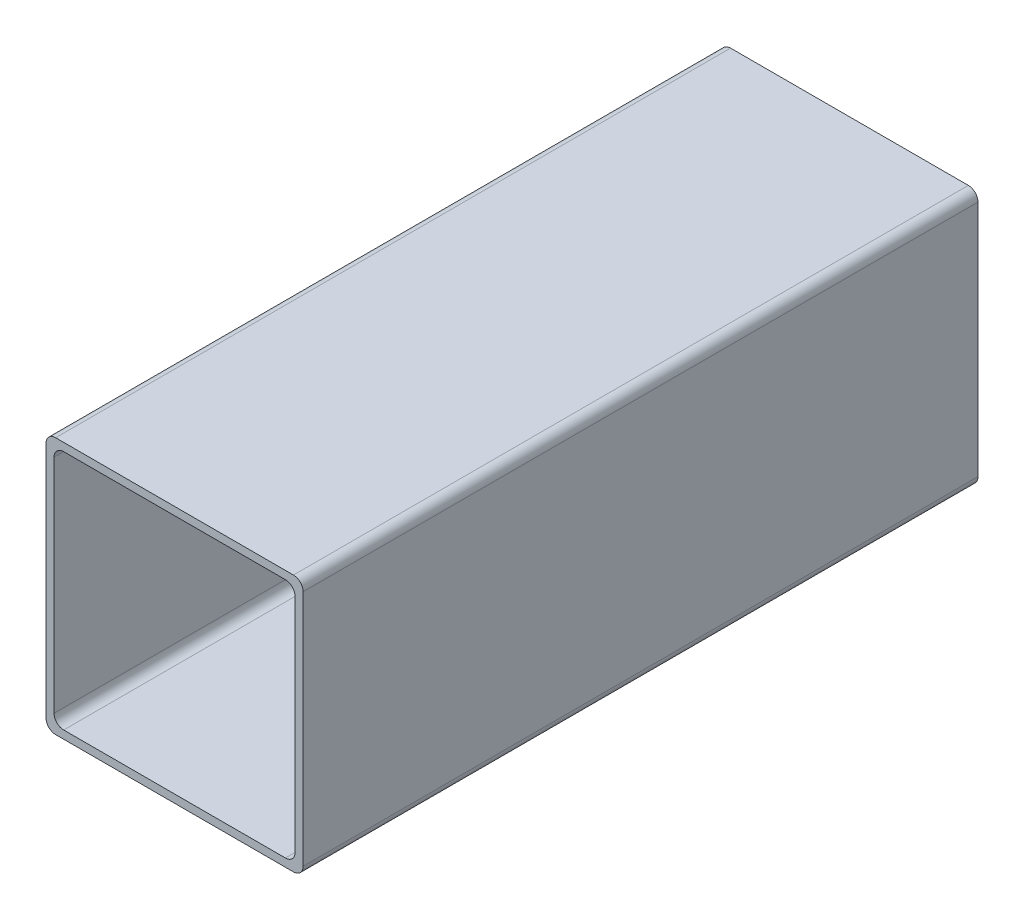
ISO-10303-21;
HEADER;
FILE_DESCRIPTION(('STEP AP214'),'2;1');
FILE_NAME('part.step','',(''),(''),'','','');
FILE_SCHEMA(('AUTOMOTIVE_DESIGN { 1 0 10303 214 1 1 1 1 }'));
ENDSEC;
DATA;
#1=APPLICATION_CONTEXT('core data for automotive mechanical design processes');
#2=APPLICATION_PROTOCOL_DEFINITION('international standard','automotive_design',2000,#1);
#3=PRODUCT_CONTEXT('',#1,'mechanical');
#4=PRODUCT('Part','Part','',(#3));
#5=PRODUCT_RELATED_PRODUCT_CATEGORY('part','',(#4));
#6=PRODUCT_DEFINITION_FORMATION('','',#4);
#7=PRODUCT_DEFINITION_CONTEXT('part definition',#1,'design');
#8=PRODUCT_DEFINITION('design','',#6,#7);
#9=PRODUCT_DEFINITION_SHAPE('','',#8);
#10=(LENGTH_UNIT() NAMED_UNIT(*) SI_UNIT(.MILLI.,.METRE.));
#11=(NAMED_UNIT(*) PLANE_ANGLE_UNIT() SI_UNIT($,.RADIAN.));
#12=(NAMED_UNIT(*) SI_UNIT($,.STERADIAN.) SOLID_ANGLE_UNIT());
#13=UNCERTAINTY_MEASURE_WITH_UNIT(LENGTH_MEASURE(1.E-05),#10,'distance_accuracy_value','');
#14=(GEOMETRIC_REPRESENTATION_CONTEXT(3) GLOBAL_UNCERTAINTY_ASSIGNED_CONTEXT((#13)) GLOBAL_UNIT_ASSIGNED_CONTEXT((#10,
#11,#12)) REPRESENTATION_CONTEXT('',''));
#15=CARTESIAN_POINT('',(0.,0.,0.));
#16=DIRECTION('',(0.,0.,1.));
#17=DIRECTION('',(1.,0.,0.));
#18=AXIS2_PLACEMENT_3D('',#15,#16,#17);
#19=CARTESIAN_POINT('',(50.8,50.8,266.7));
#20=DIRECTION('',(-1.,0.,0.));
#21=DIRECTION('',(0.,0.,1.));
#22=AXIS2_PLACEMENT_3D('',#19,#20,#21);
#23=PLANE('',#22);
#24=DIRECTION('',(0.,1.,0.));
#25=VECTOR('',#24,1.);
#26=CARTESIAN_POINT('',(50.8,50.8,266.7));
#27=LINE('',#26,#25);
#28=CARTESIAN_POINT('',(50.8,-46.99,266.7));
#29=VERTEX_POINT('',#28);
#30=CARTESIAN_POINT('',(50.8,46.99,266.7));
#31=VERTEX_POINT('',#30);
#32=EDGE_CURVE('E188',#29,#31,#27,.T.);
#33=ORIENTED_EDGE('',*,*,#32,.F.);
#34=DIRECTION('',(0.,0.,-1.));
#35=VECTOR('',#34,1.);
#36=CARTESIAN_POINT('',(50.8,-46.99,266.7));
#37=LINE('',#36,#35);
#38=CARTESIAN_POINT('',(50.8,-46.99,0.));
#39=VERTEX_POINT('',#38);
#40=EDGE_CURVE('E236',#29,#39,#37,.T.);
#41=ORIENTED_EDGE('',*,*,#40,.T.);
#42=DIRECTION('',(0.,1.,0.));
#43=VECTOR('',#42,1.);
#44=CARTESIAN_POINT('',(50.8,50.8,0.));
#45=LINE('',#44,#43);
#46=CARTESIAN_POINT('',(50.8,46.99,0.));
#47=VERTEX_POINT('',#46);
#48=EDGE_CURVE('E199',#39,#47,#45,.T.);
#49=ORIENTED_EDGE('',*,*,#48,.T.);
#50=DIRECTION('',(0.,0.,-1.));
#51=VECTOR('',#50,1.);
#52=CARTESIAN_POINT('',(50.8,46.99,266.7));
#53=LINE('',#52,#51);
#54=EDGE_CURVE('E234',#47,#31,#53,.F.);
#55=ORIENTED_EDGE('',*,*,#54,.T.);
#56=EDGE_LOOP('',(#33,#41,#49,#55));
#57=FACE_BOUND('',#56,.T.);
#58=ADVANCED_FACE('F37',(#57),#23,.F.);
#59=CARTESIAN_POINT('',(-50.8,50.8,266.7));
#60=DIRECTION('',(0.,-1.,0.));
#61=DIRECTION('',(0.,0.,-1.));
#62=AXIS2_PLACEMENT_3D('',#59,#60,#61);
#63=PLANE('',#62);
#64=DIRECTION('',(-1.,0.,0.));
#65=VECTOR('',#64,1.);
#66=CARTESIAN_POINT('',(-50.8,50.8,0.));
#67=LINE('',#66,#65);
#68=CARTESIAN_POINT('',(46.99,50.8,0.));
#69=VERTEX_POINT('',#68);
#70=CARTESIAN_POINT('',(-46.99,50.8,0.));
#71=VERTEX_POINT('',#70);
#72=EDGE_CURVE('E202',#69,#71,#67,.T.);
#73=ORIENTED_EDGE('',*,*,#72,.T.);
#74=DIRECTION('',(0.,0.,-1.));
#75=VECTOR('',#74,1.);
#76=CARTESIAN_POINT('',(-46.99,50.8,266.7));
#77=LINE('',#76,#75);
#78=CARTESIAN_POINT('',(-46.99,50.8,266.7));
#79=VERTEX_POINT('',#78);
#80=EDGE_CURVE('E11',#71,#79,#77,.F.);
#81=ORIENTED_EDGE('',*,*,#80,.T.);
#82=DIRECTION('',(-1.,0.,0.));
#83=VECTOR('',#82,1.);
#84=CARTESIAN_POINT('',(-50.8,50.8,266.7));
#85=LINE('',#84,#83);
#86=CARTESIAN_POINT('',(46.99,50.8,266.7));
#87=VERTEX_POINT('',#86);
#88=EDGE_CURVE('E191',#87,#79,#85,.T.);
#89=ORIENTED_EDGE('',*,*,#88,.F.);
#90=DIRECTION('',(0.,0.,-1.));
#91=VECTOR('',#90,1.);
#92=CARTESIAN_POINT('',(46.99,50.8,266.7));
#93=LINE('',#92,#91);
#94=EDGE_CURVE('E45',#87,#69,#93,.T.);
#95=ORIENTED_EDGE('',*,*,#94,.T.);
#96=EDGE_LOOP('',(#73,#81,#89,#95));
#97=FACE_BOUND('',#96,.T.);
#98=ADVANCED_FACE('F267',(#97),#63,.F.);
#99=CARTESIAN_POINT('',(-50.8,50.8,266.7));
#100=DIRECTION('',(1.,0.,0.));
#101=DIRECTION('',(0.,0.,-1.));
#102=AXIS2_PLACEMENT_3D('',#99,#100,#101);
#103=PLANE('',#102);
#104=DIRECTION('',(0.,-1.,0.));
#105=VECTOR('',#104,1.);
#106=CARTESIAN_POINT('',(-50.8,50.8,0.));
#107=LINE('',#106,#105);
#108=CARTESIAN_POINT('',(-50.8,46.99,0.));
#109=VERTEX_POINT('',#108);
#110=CARTESIAN_POINT('',(-50.8,-46.99,0.));
#111=VERTEX_POINT('',#110);
#112=EDGE_CURVE('E205',#109,#111,#107,.T.);
#113=ORIENTED_EDGE('',*,*,#112,.T.);
#114=DIRECTION('',(0.,0.,-1.));
#115=VECTOR('',#114,1.);
#116=CARTESIAN_POINT('',(-50.8,-46.99,266.7));
#117=LINE('',#116,#115);
#118=CARTESIAN_POINT('',(-50.8,-46.99,266.7));
#119=VERTEX_POINT('',#118);
#120=EDGE_CURVE('E52',#111,#119,#117,.F.);
#121=ORIENTED_EDGE('',*,*,#120,.T.);
#122=DIRECTION('',(0.,-1.,0.));
#123=VECTOR('',#122,1.);
#124=CARTESIAN_POINT('',(-50.8,50.8,266.7));
#125=LINE('',#124,#123);
#126=CARTESIAN_POINT('',(-50.8,46.99,266.7));
#127=VERTEX_POINT('',#126);
#128=EDGE_CURVE('E194',#127,#119,#125,.T.);
#129=ORIENTED_EDGE('',*,*,#128,.F.);
#130=DIRECTION('',(0.,0.,-1.));
#131=VECTOR('',#130,1.);
#132=CARTESIAN_POINT('',(-50.8,46.99,266.7));
#133=LINE('',#132,#131);
#134=EDGE_CURVE('E259',#127,#109,#133,.T.);
#135=ORIENTED_EDGE('',*,*,#134,.T.);
#136=EDGE_LOOP('',(#113,#121,#129,#135));
#137=FACE_BOUND('',#136,.T.);
#138=ADVANCED_FACE('F278',(#137),#103,.F.);
#139=CARTESIAN_POINT('',(-50.8,-50.8,266.7));
#140=DIRECTION('',(0.,1.,0.));
#141=DIRECTION('',(0.,0.,1.));
#142=AXIS2_PLACEMENT_3D('',#139,#140,#141);
#143=PLANE('',#142);
#144=DIRECTION('',(1.,0.,0.));
#145=VECTOR('',#144,1.);
#146=CARTESIAN_POINT('',(-50.8,-50.8,0.));
#147=LINE('',#146,#145);
#148=CARTESIAN_POINT('',(-46.99,-50.8,0.));
#149=VERTEX_POINT('',#148);
#150=CARTESIAN_POINT('',(46.99,-50.8,0.));
#151=VERTEX_POINT('',#150);
#152=EDGE_CURVE('E192',#149,#151,#147,.T.);
#153=ORIENTED_EDGE('',*,*,#152,.T.);
#154=DIRECTION('',(0.,0.,-1.));
#155=VECTOR('',#154,1.);
#156=CARTESIAN_POINT('',(46.99,-50.8,266.7));
#157=LINE('',#156,#155);
#158=CARTESIAN_POINT('',(46.99,-50.8,266.7));
#159=VERTEX_POINT('',#158);
#160=EDGE_CURVE('E250',#151,#159,#157,.F.);
#161=ORIENTED_EDGE('',*,*,#160,.T.);
#162=DIRECTION('',(1.,0.,0.));
#163=VECTOR('',#162,1.);
#164=CARTESIAN_POINT('',(-50.8,-50.8,266.7));
#165=LINE('',#164,#163);
#166=CARTESIAN_POINT('',(-46.99,-50.8,266.7));
#167=VERTEX_POINT('',#166);
#168=EDGE_CURVE('E196',#167,#159,#165,.T.);
#169=ORIENTED_EDGE('',*,*,#168,.F.);
#170=DIRECTION('',(0.,0.,-1.));
#171=VECTOR('',#170,1.);
#172=CARTESIAN_POINT('',(-46.99,-50.8,266.7));
#173=LINE('',#172,#171);
#174=EDGE_CURVE('E247',#167,#149,#173,.T.);
#175=ORIENTED_EDGE('',*,*,#174,.T.);
#176=EDGE_LOOP('',(#153,#161,#169,#175));
#177=FACE_BOUND('',#176,.T.);
#178=ADVANCED_FACE('F286',(#177),#143,.F.);
#179=CARTESIAN_POINT('',(0.,0.,266.7));
#180=DIRECTION('',(0.,0.,1.));
#181=DIRECTION('',(1.,0.,0.));
#182=AXIS2_PLACEMENT_3D('',#179,#180,#181);
#183=PLANE('',#182);
#184=DIRECTION('',(0.,1.,0.));
#185=VECTOR('',#184,1.);
#186=CARTESIAN_POINT('',(47.625,47.625,266.7));
#187=LINE('',#186,#185);
#188=CARTESIAN_POINT('',(47.625,-43.815,266.7));
#189=VERTEX_POINT('',#188);
#190=CARTESIAN_POINT('',(47.625,43.815,266.7));
#191=VERTEX_POINT('',#190);
#192=EDGE_CURVE('E460',#189,#191,#187,.T.);
#193=ORIENTED_EDGE('',*,*,#192,.F.);
#194=CARTESIAN_POINT('',(43.815,-43.815,266.7));
#195=DIRECTION('',(0.,0.,1.));
#196=DIRECTION('',(1.,0.,0.));
#197=AXIS2_PLACEMENT_3D('',#194,#195,#196);
#198=CIRCLE('',#197,3.81);
#199=CARTESIAN_POINT('',(43.815,-47.625,266.7));
#200=VERTEX_POINT('',#199);
#201=EDGE_CURVE('E177',#189,#200,#198,.F.);
#202=ORIENTED_EDGE('',*,*,#201,.T.);
#203=DIRECTION('',(1.,0.,0.));
#204=VECTOR('',#203,1.);
#205=CARTESIAN_POINT('',(-47.625,-47.625,266.7));
#206=LINE('',#205,#204);
#207=CARTESIAN_POINT('',(-43.815,-47.625,266.7));
#208=VERTEX_POINT('',#207);
#209=EDGE_CURVE('E168',#208,#200,#206,.T.);
#210=ORIENTED_EDGE('',*,*,#209,.F.);
#211=CARTESIAN_POINT('',(-43.815,-43.815,266.7));
#212=DIRECTION('',(0.,0.,1.));
#213=DIRECTION('',(1.,0.,0.));
#214=AXIS2_PLACEMENT_3D('',#211,#212,#213);
#215=CIRCLE('',#214,3.81);
#216=CARTESIAN_POINT('',(-47.625,-43.815,266.7));
#217=VERTEX_POINT('',#216);
#218=EDGE_CURVE('E151',#208,#217,#215,.F.);
#219=ORIENTED_EDGE('',*,*,#218,.T.);
#220=DIRECTION('',(0.,-1.,0.));
#221=VECTOR('',#220,1.);
#222=CARTESIAN_POINT('',(-47.625,47.625,266.7));
#223=LINE('',#222,#221);
#224=CARTESIAN_POINT('',(-47.625,43.815,266.7));
#225=VERTEX_POINT('',#224);
#226=EDGE_CURVE('E179',#225,#217,#223,.T.);
#227=ORIENTED_EDGE('',*,*,#226,.F.);
#228=CARTESIAN_POINT('',(-43.815,43.815,266.7));
#229=DIRECTION('',(0.,0.,1.));
#230=DIRECTION('',(1.,0.,0.));
#231=AXIS2_PLACEMENT_3D('',#228,#229,#230);
#232=CIRCLE('',#231,3.81);
#233=CARTESIAN_POINT('',(-43.815,47.625,266.7));
#234=VERTEX_POINT('',#233);
#235=EDGE_CURVE('E230',#225,#234,#232,.F.);
#236=ORIENTED_EDGE('',*,*,#235,.T.);
#237=DIRECTION('',(-1.,0.,0.));
#238=VECTOR('',#237,1.);
#239=CARTESIAN_POINT('',(-47.625,47.625,266.7));
#240=LINE('',#239,#238);
#241=CARTESIAN_POINT('',(43.815,47.625,266.7));
#242=VERTEX_POINT('',#241);
#243=EDGE_CURVE('E184',#242,#234,#240,.T.);
#244=ORIENTED_EDGE('',*,*,#243,.F.);
#245=CARTESIAN_POINT('',(43.815,43.815,266.7));
#246=DIRECTION('',(0.,0.,1.));
#247=DIRECTION('',(1.,0.,0.));
#248=AXIS2_PLACEMENT_3D('',#245,#246,#247);
#249=CIRCLE('',#248,3.81);
#250=EDGE_CURVE('E226',#242,#191,#249,.F.);
#251=ORIENTED_EDGE('',*,*,#250,.T.);
#252=EDGE_LOOP('',(#193,#202,#210,#219,#227,#236,#244,#251));
#253=FACE_BOUND('',#252,.T.);
#254=ORIENTED_EDGE('',*,*,#168,.T.);
#255=CARTESIAN_POINT('',(46.99,-46.99,266.7));
#256=DIRECTION('',(0.,0.,1.));
#257=DIRECTION('',(1.,0.,0.));
#258=AXIS2_PLACEMENT_3D('',#255,#256,#257);
#259=CIRCLE('',#258,3.81);
#260=EDGE_CURVE('E257',#159,#29,#259,.T.);
#261=ORIENTED_EDGE('',*,*,#260,.T.);
#262=ORIENTED_EDGE('',*,*,#32,.T.);
#263=CARTESIAN_POINT('',(46.99,46.99,266.7));
#264=DIRECTION('',(0.,0.,1.));
#265=DIRECTION('',(1.,0.,0.));
#266=AXIS2_PLACEMENT_3D('',#263,#264,#265);
#267=CIRCLE('',#266,3.81);
#268=EDGE_CURVE('E252',#31,#87,#267,.T.);
#269=ORIENTED_EDGE('',*,*,#268,.T.);
#270=ORIENTED_EDGE('',*,*,#88,.T.);
#271=CARTESIAN_POINT('',(-46.99,46.99,266.7));
#272=DIRECTION('',(0.,0.,1.));
#273=DIRECTION('',(1.,0.,0.));
#274=AXIS2_PLACEMENT_3D('',#271,#272,#273);
#275=CIRCLE('',#274,3.81);
#276=EDGE_CURVE('E59',#79,#127,#275,.T.);
#277=ORIENTED_EDGE('',*,*,#276,.T.);
#278=ORIENTED_EDGE('',*,*,#128,.T.);
#279=CARTESIAN_POINT('',(-46.99,-46.99,266.7));
#280=DIRECTION('',(0.,0.,1.));
#281=DIRECTION('',(1.,0.,0.));
#282=AXIS2_PLACEMENT_3D('',#279,#280,#281);
#283=CIRCLE('',#282,3.81);
#284=EDGE_CURVE('E255',#119,#167,#283,.T.);
#285=ORIENTED_EDGE('',*,*,#284,.T.);
#286=EDGE_LOOP('',(#254,#261,#262,#269,#270,#277,#278,#285));
#287=FACE_BOUND('',#286,.T.);
#288=ADVANCED_FACE('F176',(#253,#287),#183,.T.);
#289=CARTESIAN_POINT('',(0.,0.,0.));
#290=DIRECTION('',(0.,0.,1.));
#291=DIRECTION('',(1.,0.,0.));
#292=AXIS2_PLACEMENT_3D('',#289,#290,#291);
#293=PLANE('',#292);
#294=DIRECTION('',(0.,-1.,0.));
#295=VECTOR('',#294,1.);
#296=CARTESIAN_POINT('',(-47.625,47.625,0.));
#297=LINE('',#296,#295);
#298=CARTESIAN_POINT('',(-47.625,43.815,0.));
#299=VERTEX_POINT('',#298);
#300=CARTESIAN_POINT('',(-47.625,-43.815,0.));
#301=VERTEX_POINT('',#300);
#302=EDGE_CURVE('E452',#299,#301,#297,.T.);
#303=ORIENTED_EDGE('',*,*,#302,.T.);
#304=CARTESIAN_POINT('',(-43.815,-43.815,0.));
#305=DIRECTION('',(0.,0.,1.));
#306=DIRECTION('',(1.,0.,0.));
#307=AXIS2_PLACEMENT_3D('',#304,#305,#306);
#308=CIRCLE('',#307,3.81);
#309=CARTESIAN_POINT('',(-43.815,-47.625,0.));
#310=VERTEX_POINT('',#309);
#311=EDGE_CURVE('E161',#301,#310,#308,.T.);
#312=ORIENTED_EDGE('',*,*,#311,.T.);
#313=DIRECTION('',(1.,0.,0.));
#314=VECTOR('',#313,1.);
#315=CARTESIAN_POINT('',(-47.625,-47.625,0.));
#316=LINE('',#315,#314);
#317=CARTESIAN_POINT('',(43.815,-47.625,0.));
#318=VERTEX_POINT('',#317);
#319=EDGE_CURVE('E171',#310,#318,#316,.T.);
#320=ORIENTED_EDGE('',*,*,#319,.T.);
#321=CARTESIAN_POINT('',(43.815,-43.815,0.));
#322=DIRECTION('',(0.,0.,1.));
#323=DIRECTION('',(1.,0.,0.));
#324=AXIS2_PLACEMENT_3D('',#321,#322,#323);
#325=CIRCLE('',#324,3.81);
#326=CARTESIAN_POINT('',(47.625,-43.815,0.));
#327=VERTEX_POINT('',#326);
#328=EDGE_CURVE('E224',#318,#327,#325,.T.);
#329=ORIENTED_EDGE('',*,*,#328,.T.);
#330=DIRECTION('',(0.,1.,0.));
#331=VECTOR('',#330,1.);
#332=CARTESIAN_POINT('',(47.625,47.625,0.));
#333=LINE('',#332,#331);
#334=CARTESIAN_POINT('',(47.625,43.815,0.));
#335=VERTEX_POINT('',#334);
#336=EDGE_CURVE('E178',#327,#335,#333,.T.);
#337=ORIENTED_EDGE('',*,*,#336,.T.);
#338=CARTESIAN_POINT('',(43.815,43.815,0.));
#339=DIRECTION('',(0.,0.,1.));
#340=DIRECTION('',(1.,0.,0.));
#341=AXIS2_PLACEMENT_3D('',#338,#339,#340);
#342=CIRCLE('',#341,3.81);
#343=CARTESIAN_POINT('',(43.815,47.625,0.));
#344=VERTEX_POINT('',#343);
#345=EDGE_CURVE('E228',#335,#344,#342,.T.);
#346=ORIENTED_EDGE('',*,*,#345,.T.);
#347=DIRECTION('',(-1.,0.,0.));
#348=VECTOR('',#347,1.);
#349=CARTESIAN_POINT('',(-47.625,47.625,0.));
#350=LINE('',#349,#348);
#351=CARTESIAN_POINT('',(-43.815,47.625,0.));
#352=VERTEX_POINT('',#351);
#353=EDGE_CURVE('E182',#344,#352,#350,.T.);
#354=ORIENTED_EDGE('',*,*,#353,.T.);
#355=CARTESIAN_POINT('',(-43.815,43.815,0.));
#356=DIRECTION('',(0.,0.,1.));
#357=DIRECTION('',(1.,0.,0.));
#358=AXIS2_PLACEMENT_3D('',#355,#356,#357);
#359=CIRCLE('',#358,3.81);
#360=EDGE_CURVE('E232',#352,#299,#359,.T.);
#361=ORIENTED_EDGE('',*,*,#360,.T.);
#362=EDGE_LOOP('',(#303,#312,#320,#329,#337,#346,#354,#361));
#363=FACE_BOUND('',#362,.T.);
#364=ORIENTED_EDGE('',*,*,#48,.F.);
#365=CARTESIAN_POINT('',(46.99,-46.99,0.));
#366=DIRECTION('',(0.,0.,1.));
#367=DIRECTION('',(1.,0.,0.));
#368=AXIS2_PLACEMENT_3D('',#365,#366,#367);
#369=CIRCLE('',#368,3.81);
#370=EDGE_CURVE('E245',#39,#151,#369,.F.);
#371=ORIENTED_EDGE('',*,*,#370,.T.);
#372=ORIENTED_EDGE('',*,*,#152,.F.);
#373=CARTESIAN_POINT('',(-46.99,-46.99,0.));
#374=DIRECTION('',(0.,0.,1.));
#375=DIRECTION('',(1.,0.,0.));
#376=AXIS2_PLACEMENT_3D('',#373,#374,#375);
#377=CIRCLE('',#376,3.81);
#378=EDGE_CURVE('E243',#149,#111,#377,.F.);
#379=ORIENTED_EDGE('',*,*,#378,.T.);
#380=ORIENTED_EDGE('',*,*,#112,.F.);
#381=CARTESIAN_POINT('',(-46.99,46.99,0.));
#382=DIRECTION('',(0.,0.,1.));
#383=DIRECTION('',(1.,0.,0.));
#384=AXIS2_PLACEMENT_3D('',#381,#382,#383);
#385=CIRCLE('',#384,3.81);
#386=EDGE_CURVE('E241',#109,#71,#385,.F.);
#387=ORIENTED_EDGE('',*,*,#386,.T.);
#388=ORIENTED_EDGE('',*,*,#72,.F.);
#389=CARTESIAN_POINT('',(46.99,46.99,0.));
#390=DIRECTION('',(0.,0.,1.));
#391=DIRECTION('',(1.,0.,0.));
#392=AXIS2_PLACEMENT_3D('',#389,#390,#391);
#393=CIRCLE('',#392,3.81);
#394=EDGE_CURVE('E239',#69,#47,#393,.F.);
#395=ORIENTED_EDGE('',*,*,#394,.T.);
#396=EDGE_LOOP('',(#364,#371,#372,#379,#380,#387,#388,#395));
#397=FACE_BOUND('',#396,.T.);
#398=ADVANCED_FACE('F273',(#363,#397),#293,.F.);
#399=CARTESIAN_POINT('',(47.625,47.625,0.));
#400=DIRECTION('',(1.,0.,0.));
#401=DIRECTION('',(0.,1.,0.));
#402=AXIS2_PLACEMENT_3D('',#399,#400,#401);
#403=PLANE('',#402);
#404=ORIENTED_EDGE('',*,*,#336,.F.);
#405=DIRECTION('',(0.,0.,1.));
#406=VECTOR('',#405,1.);
#407=CARTESIAN_POINT('',(47.625,-43.815,266.7));
#408=LINE('',#407,#406);
#409=EDGE_CURVE('E215',#327,#189,#408,.T.);
#410=ORIENTED_EDGE('',*,*,#409,.T.);
#411=ORIENTED_EDGE('',*,*,#192,.T.);
#412=DIRECTION('',(0.,0.,1.));
#413=VECTOR('',#412,1.);
#414=CARTESIAN_POINT('',(47.625,43.815,0.));
#415=LINE('',#414,#413);
#416=EDGE_CURVE('E213',#191,#335,#415,.F.);
#417=ORIENTED_EDGE('',*,*,#416,.T.);
#418=EDGE_LOOP('',(#404,#410,#411,#417));
#419=FACE_BOUND('',#418,.T.);
#420=ADVANCED_FACE('F391',(#419),#403,.F.);
#421=CARTESIAN_POINT('',(-47.625,-47.625,0.));
#422=DIRECTION('',(0.,-1.,0.));
#423=DIRECTION('',(0.,0.,-1.));
#424=AXIS2_PLACEMENT_3D('',#421,#422,#423);
#425=PLANE('',#424);
#426=ORIENTED_EDGE('',*,*,#319,.F.);
#427=DIRECTION('',(0.,0.,1.));
#428=VECTOR('',#427,1.);
#429=CARTESIAN_POINT('',(-43.815,-47.625,266.7));
#430=LINE('',#429,#428);
#431=EDGE_CURVE('E155',#310,#208,#430,.T.);
#432=ORIENTED_EDGE('',*,*,#431,.T.);
#433=ORIENTED_EDGE('',*,*,#209,.T.);
#434=DIRECTION('',(0.,0.,1.));
#435=VECTOR('',#434,1.);
#436=CARTESIAN_POINT('',(43.815,-47.625,0.));
#437=LINE('',#436,#435);
#438=EDGE_CURVE('E173',#200,#318,#437,.F.);
#439=ORIENTED_EDGE('',*,*,#438,.T.);
#440=EDGE_LOOP('',(#426,#432,#433,#439));
#441=FACE_BOUND('',#440,.T.);
#442=ADVANCED_FACE('F167',(#441),#425,.F.);
#443=CARTESIAN_POINT('',(-47.625,47.625,0.));
#444=DIRECTION('',(-1.,0.,0.));
#445=DIRECTION('',(0.,-1.,0.));
#446=AXIS2_PLACEMENT_3D('',#443,#444,#445);
#447=PLANE('',#446);
#448=ORIENTED_EDGE('',*,*,#226,.T.);
#449=DIRECTION('',(0.,0.,1.));
#450=VECTOR('',#449,1.);
#451=CARTESIAN_POINT('',(-47.625,-43.815,0.));
#452=LINE('',#451,#450);
#453=EDGE_CURVE('E156',#217,#301,#452,.F.);
#454=ORIENTED_EDGE('',*,*,#453,.T.);
#455=ORIENTED_EDGE('',*,*,#302,.F.);
#456=DIRECTION('',(0.,0.,1.));
#457=VECTOR('',#456,1.);
#458=CARTESIAN_POINT('',(-47.625,43.815,266.7));
#459=LINE('',#458,#457);
#460=EDGE_CURVE('E172',#299,#225,#459,.T.);
#461=ORIENTED_EDGE('',*,*,#460,.T.);
#462=EDGE_LOOP('',(#448,#454,#455,#461));
#463=FACE_BOUND('',#462,.T.);
#464=ADVANCED_FACE('F374',(#463),#447,.F.);
#465=CARTESIAN_POINT('',(-47.625,47.625,0.));
#466=DIRECTION('',(0.,1.,0.));
#467=DIRECTION('',(0.,0.,1.));
#468=AXIS2_PLACEMENT_3D('',#465,#466,#467);
#469=PLANE('',#468);
#470=ORIENTED_EDGE('',*,*,#353,.F.);
#471=DIRECTION('',(0.,0.,1.));
#472=VECTOR('',#471,1.);
#473=CARTESIAN_POINT('',(43.815,47.625,266.7));
#474=LINE('',#473,#472);
#475=EDGE_CURVE('E162',#344,#242,#474,.T.);
#476=ORIENTED_EDGE('',*,*,#475,.T.);
#477=ORIENTED_EDGE('',*,*,#243,.T.);
#478=DIRECTION('',(0.,0.,1.));
#479=VECTOR('',#478,1.);
#480=CARTESIAN_POINT('',(-43.815,47.625,0.));
#481=LINE('',#480,#479);
#482=EDGE_CURVE('E218',#234,#352,#481,.F.);
#483=ORIENTED_EDGE('',*,*,#482,.T.);
#484=EDGE_LOOP('',(#470,#476,#477,#483));
#485=FACE_BOUND('',#484,.T.);
#486=ADVANCED_FACE('F310',(#485),#469,.F.);
#487=CARTESIAN_POINT('',(-43.815,-43.815,0.));
#488=DIRECTION('',(0.,0.,-1.));
#489=DIRECTION('',(-1.,0.,0.));
#490=AXIS2_PLACEMENT_3D('',#487,#488,#489);
#491=CYLINDRICAL_SURFACE('',#490,3.81);
#492=ORIENTED_EDGE('',*,*,#311,.F.);
#493=ORIENTED_EDGE('',*,*,#453,.F.);
#494=ORIENTED_EDGE('',*,*,#218,.F.);
#495=ORIENTED_EDGE('',*,*,#431,.F.);
#496=EDGE_LOOP('',(#492,#493,#494,#495));
#497=FACE_BOUND('',#496,.T.);
#498=ADVANCED_FACE('F154',(#497),#491,.F.);
#499=CARTESIAN_POINT('',(43.815,-43.815,0.));
#500=DIRECTION('',(0.,0.,-1.));
#501=DIRECTION('',(-1.,0.,0.));
#502=AXIS2_PLACEMENT_3D('',#499,#500,#501);
#503=CYLINDRICAL_SURFACE('',#502,3.81);
#504=ORIENTED_EDGE('',*,*,#328,.F.);
#505=ORIENTED_EDGE('',*,*,#438,.F.);
#506=ORIENTED_EDGE('',*,*,#201,.F.);
#507=ORIENTED_EDGE('',*,*,#409,.F.);
#508=EDGE_LOOP('',(#504,#505,#506,#507));
#509=FACE_BOUND('',#508,.T.);
#510=ADVANCED_FACE('F309',(#509),#503,.F.);
#511=CARTESIAN_POINT('',(43.815,43.815,0.));
#512=DIRECTION('',(0.,0.,-1.));
#513=DIRECTION('',(-1.,0.,0.));
#514=AXIS2_PLACEMENT_3D('',#511,#512,#513);
#515=CYLINDRICAL_SURFACE('',#514,3.81);
#516=ORIENTED_EDGE('',*,*,#345,.F.);
#517=ORIENTED_EDGE('',*,*,#416,.F.);
#518=ORIENTED_EDGE('',*,*,#250,.F.);
#519=ORIENTED_EDGE('',*,*,#475,.F.);
#520=EDGE_LOOP('',(#516,#517,#518,#519));
#521=FACE_BOUND('',#520,.T.);
#522=ADVANCED_FACE('F313',(#521),#515,.F.);
#523=CARTESIAN_POINT('',(-43.815,43.815,0.));
#524=DIRECTION('',(0.,0.,-1.));
#525=DIRECTION('',(-1.,0.,0.));
#526=AXIS2_PLACEMENT_3D('',#523,#524,#525);
#527=CYLINDRICAL_SURFACE('',#526,3.81);
#528=ORIENTED_EDGE('',*,*,#360,.F.);
#529=ORIENTED_EDGE('',*,*,#482,.F.);
#530=ORIENTED_EDGE('',*,*,#235,.F.);
#531=ORIENTED_EDGE('',*,*,#460,.F.);
#532=EDGE_LOOP('',(#528,#529,#530,#531));
#533=FACE_BOUND('',#532,.T.);
#534=ADVANCED_FACE('F317',(#533),#527,.F.);
#535=CARTESIAN_POINT('',(46.99,-46.99,266.7));
#536=DIRECTION('',(0.,0.,-1.));
#537=DIRECTION('',(-1.,0.,0.));
#538=AXIS2_PLACEMENT_3D('',#535,#536,#537);
#539=CYLINDRICAL_SURFACE('',#538,3.81);
#540=ORIENTED_EDGE('',*,*,#260,.F.);
#541=ORIENTED_EDGE('',*,*,#160,.F.);
#542=ORIENTED_EDGE('',*,*,#370,.F.);
#543=ORIENTED_EDGE('',*,*,#40,.F.);
#544=EDGE_LOOP('',(#540,#541,#542,#543));
#545=FACE_BOUND('',#544,.T.);
#546=ADVANCED_FACE('F291',(#545),#539,.T.);
#547=CARTESIAN_POINT('',(-46.99,-46.99,266.7));
#548=DIRECTION('',(0.,0.,-1.));
#549=DIRECTION('',(-1.,0.,0.));
#550=AXIS2_PLACEMENT_3D('',#547,#548,#549);
#551=CYLINDRICAL_SURFACE('',#550,3.81);
#552=ORIENTED_EDGE('',*,*,#284,.F.);
#553=ORIENTED_EDGE('',*,*,#120,.F.);
#554=ORIENTED_EDGE('',*,*,#378,.F.);
#555=ORIENTED_EDGE('',*,*,#174,.F.);
#556=EDGE_LOOP('',(#552,#553,#554,#555));
#557=FACE_BOUND('',#556,.T.);
#558=ADVANCED_FACE('F283',(#557),#551,.T.);
#559=CARTESIAN_POINT('',(-46.99,46.99,266.7));
#560=DIRECTION('',(0.,0.,-1.));
#561=DIRECTION('',(-1.,0.,0.));
#562=AXIS2_PLACEMENT_3D('',#559,#560,#561);
#563=CYLINDRICAL_SURFACE('',#562,3.81);
#564=ORIENTED_EDGE('',*,*,#276,.F.);
#565=ORIENTED_EDGE('',*,*,#80,.F.);
#566=ORIENTED_EDGE('',*,*,#386,.F.);
#567=ORIENTED_EDGE('',*,*,#134,.F.);
#568=EDGE_LOOP('',(#564,#565,#566,#567));
#569=FACE_BOUND('',#568,.T.);
#570=ADVANCED_FACE('F277',(#569),#563,.T.);
#571=CARTESIAN_POINT('',(46.99,46.99,266.7));
#572=DIRECTION('',(0.,0.,-1.));
#573=DIRECTION('',(-1.,0.,0.));
#574=AXIS2_PLACEMENT_3D('',#571,#572,#573);
#575=CYLINDRICAL_SURFACE('',#574,3.81);
#576=ORIENTED_EDGE('',*,*,#268,.F.);
#577=ORIENTED_EDGE('',*,*,#54,.F.);
#578=ORIENTED_EDGE('',*,*,#394,.F.);
#579=ORIENTED_EDGE('',*,*,#94,.F.);
#580=EDGE_LOOP('',(#576,#577,#578,#579));
#581=FACE_BOUND('',#580,.T.);
#582=ADVANCED_FACE('F39',(#581),#575,.T.);
#583=CLOSED_SHELL('',(#58,#98,#138,#178,#288,#398,#420,#442,#464,#486,#498,#510,#522,#534,#546,
#558,#570,#582));
#584=MANIFOLD_SOLID_BREP('B2',#583);
#585=ADVANCED_BREP_SHAPE_REPRESENTATION('',(#18,#584),#14);
#586=SHAPE_DEFINITION_REPRESENTATION(#9,#585);
ENDSEC;
END-ISO-10303-21;
